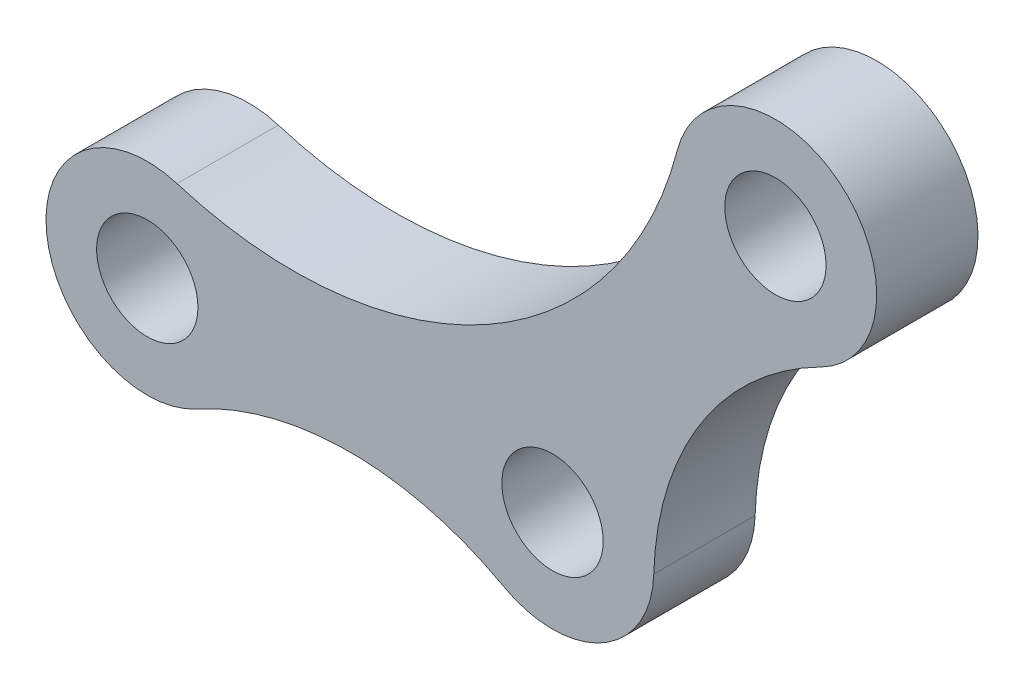
ISO-10303-21;
HEADER;
FILE_DESCRIPTION(('STEP AP214'),'2;1');
FILE_NAME('part.step','',(''),(''),'','','');
FILE_SCHEMA(('AUTOMOTIVE_DESIGN { 1 0 10303 214 1 1 1 1 }'));
ENDSEC;
DATA;
#1=APPLICATION_CONTEXT('core data for automotive mechanical design processes');
#2=APPLICATION_PROTOCOL_DEFINITION('international standard','automotive_design',2000,#1);
#3=PRODUCT_CONTEXT('',#1,'mechanical');
#4=PRODUCT('Part','Part','',(#3));
#5=PRODUCT_RELATED_PRODUCT_CATEGORY('part','',(#4));
#6=PRODUCT_DEFINITION_FORMATION('','',#4);
#7=PRODUCT_DEFINITION_CONTEXT('part definition',#1,'design');
#8=PRODUCT_DEFINITION('design','',#6,#7);
#9=PRODUCT_DEFINITION_SHAPE('','',#8);
#10=(LENGTH_UNIT() NAMED_UNIT(*) SI_UNIT(.MILLI.,.METRE.));
#11=(NAMED_UNIT(*) PLANE_ANGLE_UNIT() SI_UNIT($,.RADIAN.));
#12=(NAMED_UNIT(*) SI_UNIT($,.STERADIAN.) SOLID_ANGLE_UNIT());
#13=UNCERTAINTY_MEASURE_WITH_UNIT(LENGTH_MEASURE(1.E-05),#10,'distance_accuracy_value','');
#14=(GEOMETRIC_REPRESENTATION_CONTEXT(3) GLOBAL_UNCERTAINTY_ASSIGNED_CONTEXT((#13)) GLOBAL_UNIT_ASSIGNED_CONTEXT((#10,
#11,#12)) REPRESENTATION_CONTEXT('',''));
#15=CARTESIAN_POINT('',(0.,0.,0.));
#16=DIRECTION('',(0.,0.,1.));
#17=DIRECTION('',(1.,0.,0.));
#18=AXIS2_PLACEMENT_3D('',#15,#16,#17);
#19=CARTESIAN_POINT('',(31.,17.2988438920062,2.5));
#20=DIRECTION('',(0.,0.,1.));
#21=DIRECTION('',(1.,0.,0.));
#22=AXIS2_PLACEMENT_3D('',#19,#20,#21);
#23=PLANE('',#22);
#24=CARTESIAN_POINT('',(20.,0.,2.5));
#25=DIRECTION('',(0.,0.,1.));
#26=DIRECTION('',(1.,0.,0.));
#27=AXIS2_PLACEMENT_3D('',#24,#25,#26);
#28=CIRCLE('',#27,2.5);
#29=CARTESIAN_POINT('',(22.5,0.,2.5));
#30=VERTEX_POINT('',#29);
#31=EDGE_CURVE('E135',#30,#30,#28,.T.);
#32=ORIENTED_EDGE('',*,*,#31,.F.);
#33=EDGE_LOOP('',(#32));
#34=FACE_BOUND('',#33,.T.);
#35=CARTESIAN_POINT('',(0.,0.,2.5));
#36=DIRECTION('',(0.,0.,1.));
#37=DIRECTION('',(1.,0.,0.));
#38=AXIS2_PLACEMENT_3D('',#35,#36,#37);
#39=CIRCLE('',#38,2.5);
#40=CARTESIAN_POINT('',(2.5,0.,2.5));
#41=VERTEX_POINT('',#40);
#42=EDGE_CURVE('E141',#41,#41,#39,.T.);
#43=ORIENTED_EDGE('',*,*,#42,.F.);
#44=EDGE_LOOP('',(#43));
#45=FACE_BOUND('',#44,.T.);
#46=CARTESIAN_POINT('',(31.,17.2988438920062,2.5));
#47=DIRECTION('',(0.,0.,1.));
#48=DIRECTION('',(1.,0.,0.));
#49=AXIS2_PLACEMENT_3D('',#46,#47,#48);
#50=CIRCLE('',#49,2.5);
#51=CARTESIAN_POINT('',(33.5,17.2988438920062,2.5));
#52=VERTEX_POINT('',#51);
#53=EDGE_CURVE('E129',#52,#52,#50,.T.);
#54=ORIENTED_EDGE('',*,*,#53,.F.);
#55=EDGE_LOOP('',(#54));
#56=FACE_BOUND('',#55,.T.);
#57=CARTESIAN_POINT('',(40.004903122554,-0.573965197332155,2.5));
#58=DIRECTION('',(0.,0.,-1.));
#59=DIRECTION('',(-1.,0.,0.));
#60=AXIS2_PLACEMENT_3D('',#57,#58,#59);
#61=CIRCLE('',#60,15.0131353113528);
#62=CARTESIAN_POINT('',(24.9979433035677,-0.143397121041444,2.5));
#63=VERTEX_POINT('',#62);
#64=CARTESIAN_POINT('',(33.2497482234694,12.8335742550194,2.5));
#65=VERTEX_POINT('',#64);
#66=EDGE_CURVE('E104',#63,#65,#61,.T.);
#67=ORIENTED_EDGE('',*,*,#66,.T.);
#68=CARTESIAN_POINT('',(31.,17.2988438920062,2.5));
#69=DIRECTION('',(0.,0.,1.));
#70=DIRECTION('',(1.,0.,0.));
#71=AXIS2_PLACEMENT_3D('',#68,#69,#70);
#72=CIRCLE('',#71,5.);
#73=CARTESIAN_POINT('',(26.1617899006899,18.5604789560931,2.5));
#74=VERTEX_POINT('',#73);
#75=EDGE_CURVE('E146',#65,#74,#72,.T.);
#76=ORIENTED_EDGE('',*,*,#75,.T.);
#77=CARTESIAN_POINT('',(7.21188646422857,23.5019474218612,2.5));
#78=DIRECTION('',(0.,0.,-1.));
#79=DIRECTION('',(-1.,0.,0.));
#80=AXIS2_PLACEMENT_3D('',#77,#78,#79);
#81=CIRCLE('',#80,19.5835888143463);
#82=CARTESIAN_POINT('',(1.46680912186831,4.78000742677288,2.5));
#83=VERTEX_POINT('',#82);
#84=EDGE_CURVE('E113',#74,#83,#81,.T.);
#85=ORIENTED_EDGE('',*,*,#84,.T.);
#86=CARTESIAN_POINT('',(0.,0.,2.5));
#87=DIRECTION('',(0.,0.,1.));
#88=DIRECTION('',(1.,0.,0.));
#89=AXIS2_PLACEMENT_3D('',#86,#87,#88);
#90=CIRCLE('',#89,5.);
#91=CARTESIAN_POINT('',(2.41669641421285,-4.37716557163774,2.5));
#92=VERTEX_POINT('',#91);
#93=EDGE_CURVE('E43',#83,#92,#90,.T.);
#94=ORIENTED_EDGE('',*,*,#93,.T.);
#95=CARTESIAN_POINT('',(10.,-18.1121863130808,2.5));
#96=DIRECTION('',(0.,0.,-1.));
#97=DIRECTION('',(-1.,0.,0.));
#98=AXIS2_PLACEMENT_3D('',#95,#96,#97);
#99=CIRCLE('',#98,15.6894004997668);
#100=CARTESIAN_POINT('',(17.5833035857871,-4.37716557163774,2.5));
#101=VERTEX_POINT('',#100);
#102=EDGE_CURVE('E108',#92,#101,#99,.T.);
#103=ORIENTED_EDGE('',*,*,#102,.T.);
#104=CARTESIAN_POINT('',(20.,0.,2.5));
#105=DIRECTION('',(0.,0.,1.));
#106=DIRECTION('',(1.,0.,0.));
#107=AXIS2_PLACEMENT_3D('',#104,#105,#106);
#108=CIRCLE('',#107,5.);
#109=EDGE_CURVE('E12',#101,#63,#108,.T.);
#110=ORIENTED_EDGE('',*,*,#109,.T.);
#111=EDGE_LOOP('',(#67,#76,#85,#94,#103,#110));
#112=FACE_BOUND('',#111,.T.);
#113=ADVANCED_FACE('F34',(#34,#45,#56,#112),#23,.T.);
#114=CARTESIAN_POINT('',(31.,17.2988438920062,-2.5));
#115=DIRECTION('',(0.,0.,1.));
#116=DIRECTION('',(1.,0.,0.));
#117=AXIS2_PLACEMENT_3D('',#114,#115,#116);
#118=PLANE('',#117);
#119=CARTESIAN_POINT('',(31.,17.2988438920062,-2.5));
#120=DIRECTION('',(0.,0.,1.));
#121=DIRECTION('',(1.,0.,0.));
#122=AXIS2_PLACEMENT_3D('',#119,#120,#121);
#123=CIRCLE('',#122,2.5);
#124=CARTESIAN_POINT('',(33.5,17.2988438920062,-2.5));
#125=VERTEX_POINT('',#124);
#126=EDGE_CURVE('E118',#125,#125,#123,.T.);
#127=ORIENTED_EDGE('',*,*,#126,.T.);
#128=EDGE_LOOP('',(#127));
#129=FACE_BOUND('',#128,.T.);
#130=CARTESIAN_POINT('',(20.,0.,-2.5));
#131=DIRECTION('',(0.,0.,1.));
#132=DIRECTION('',(1.,0.,0.));
#133=AXIS2_PLACEMENT_3D('',#130,#131,#132);
#134=CIRCLE('',#133,2.5);
#135=CARTESIAN_POINT('',(22.5,0.,-2.5));
#136=VERTEX_POINT('',#135);
#137=EDGE_CURVE('E132',#136,#136,#134,.T.);
#138=ORIENTED_EDGE('',*,*,#137,.T.);
#139=EDGE_LOOP('',(#138));
#140=FACE_BOUND('',#139,.T.);
#141=CARTESIAN_POINT('',(0.,0.,-2.5));
#142=DIRECTION('',(0.,0.,1.));
#143=DIRECTION('',(1.,0.,0.));
#144=AXIS2_PLACEMENT_3D('',#141,#142,#143);
#145=CIRCLE('',#144,2.5);
#146=CARTESIAN_POINT('',(2.5,0.,-2.5));
#147=VERTEX_POINT('',#146);
#148=EDGE_CURVE('E138',#147,#147,#145,.T.);
#149=ORIENTED_EDGE('',*,*,#148,.T.);
#150=EDGE_LOOP('',(#149));
#151=FACE_BOUND('',#150,.T.);
#152=CARTESIAN_POINT('',(31.,17.2988438920062,-2.5));
#153=DIRECTION('',(0.,0.,1.));
#154=DIRECTION('',(1.,0.,0.));
#155=AXIS2_PLACEMENT_3D('',#152,#153,#154);
#156=CIRCLE('',#155,5.);
#157=CARTESIAN_POINT('',(33.2497482234694,12.8335742550194,-2.5));
#158=VERTEX_POINT('',#157);
#159=CARTESIAN_POINT('',(26.1617899006899,18.5604789560931,-2.5));
#160=VERTEX_POINT('',#159);
#161=EDGE_CURVE('E91',#158,#160,#156,.T.);
#162=ORIENTED_EDGE('',*,*,#161,.F.);
#163=CARTESIAN_POINT('',(40.004903122554,-0.573965197332155,-2.5));
#164=DIRECTION('',(0.,0.,-1.));
#165=DIRECTION('',(-1.,0.,0.));
#166=AXIS2_PLACEMENT_3D('',#163,#164,#165);
#167=CIRCLE('',#166,15.0131353113528);
#168=CARTESIAN_POINT('',(24.9979433035677,-0.143397121041444,-2.5));
#169=VERTEX_POINT('',#168);
#170=EDGE_CURVE('E98',#169,#158,#167,.T.);
#171=ORIENTED_EDGE('',*,*,#170,.F.);
#172=CARTESIAN_POINT('',(20.,0.,-2.5));
#173=DIRECTION('',(0.,0.,1.));
#174=DIRECTION('',(1.,0.,0.));
#175=AXIS2_PLACEMENT_3D('',#172,#173,#174);
#176=CIRCLE('',#175,5.);
#177=CARTESIAN_POINT('',(17.5833035857871,-4.37716557163774,-2.5));
#178=VERTEX_POINT('',#177);
#179=EDGE_CURVE('E38',#178,#169,#176,.T.);
#180=ORIENTED_EDGE('',*,*,#179,.F.);
#181=CARTESIAN_POINT('',(10.,-18.1121863130808,-2.5));
#182=DIRECTION('',(0.,0.,-1.));
#183=DIRECTION('',(-1.,0.,0.));
#184=AXIS2_PLACEMENT_3D('',#181,#182,#183);
#185=CIRCLE('',#184,15.6894004997668);
#186=CARTESIAN_POINT('',(2.41669641421285,-4.37716557163774,-2.5));
#187=VERTEX_POINT('',#186);
#188=EDGE_CURVE('E90',#187,#178,#185,.T.);
#189=ORIENTED_EDGE('',*,*,#188,.F.);
#190=CARTESIAN_POINT('',(0.,0.,-2.5));
#191=DIRECTION('',(0.,0.,1.));
#192=DIRECTION('',(1.,0.,0.));
#193=AXIS2_PLACEMENT_3D('',#190,#191,#192);
#194=CIRCLE('',#193,5.);
#195=CARTESIAN_POINT('',(1.46680912186831,4.78000742677288,-2.5));
#196=VERTEX_POINT('',#195);
#197=EDGE_CURVE('E51',#196,#187,#194,.T.);
#198=ORIENTED_EDGE('',*,*,#197,.F.);
#199=CARTESIAN_POINT('',(7.21188646422857,23.5019474218612,-2.5));
#200=DIRECTION('',(0.,0.,-1.));
#201=DIRECTION('',(-1.,0.,0.));
#202=AXIS2_PLACEMENT_3D('',#199,#200,#201);
#203=CIRCLE('',#202,19.5835888143463);
#204=EDGE_CURVE('E88',#160,#196,#203,.T.);
#205=ORIENTED_EDGE('',*,*,#204,.F.);
#206=EDGE_LOOP('',(#162,#171,#180,#189,#198,#205));
#207=FACE_BOUND('',#206,.T.);
#208=ADVANCED_FACE('F86',(#129,#140,#151,#207),#118,.F.);
#209=CARTESIAN_POINT('',(31.,17.2988438920062,2.5));
#210=DIRECTION('',(0.,0.,-1.));
#211=DIRECTION('',(-1.,0.,0.));
#212=AXIS2_PLACEMENT_3D('',#209,#210,#211);
#213=CYLINDRICAL_SURFACE('',#212,5.);
#214=ORIENTED_EDGE('',*,*,#161,.T.);
#215=DIRECTION('',(0.,0.,1.));
#216=VECTOR('',#215,1.);
#217=CARTESIAN_POINT('',(26.1617899006899,18.5604789560931,-2.5));
#218=LINE('',#217,#216);
#219=EDGE_CURVE('E103',#160,#74,#218,.T.);
#220=ORIENTED_EDGE('',*,*,#219,.T.);
#221=ORIENTED_EDGE('',*,*,#75,.F.);
#222=DIRECTION('',(0.,0.,1.));
#223=VECTOR('',#222,1.);
#224=CARTESIAN_POINT('',(33.2497482234694,12.8335742550194,-2.5));
#225=LINE('',#224,#223);
#226=EDGE_CURVE('E119',#158,#65,#225,.T.);
#227=ORIENTED_EDGE('',*,*,#226,.F.);
#228=EDGE_LOOP('',(#214,#220,#221,#227));
#229=FACE_BOUND('',#228,.T.);
#230=ADVANCED_FACE('F36',(#229),#213,.T.);
#231=CARTESIAN_POINT('',(0.,0.,2.5));
#232=DIRECTION('',(0.,0.,-1.));
#233=DIRECTION('',(-1.,0.,0.));
#234=AXIS2_PLACEMENT_3D('',#231,#232,#233);
#235=CYLINDRICAL_SURFACE('',#234,5.);
#236=ORIENTED_EDGE('',*,*,#197,.T.);
#237=DIRECTION('',(0.,0.,1.));
#238=VECTOR('',#237,1.);
#239=CARTESIAN_POINT('',(2.41669641421285,-4.37716557163774,-2.5));
#240=LINE('',#239,#238);
#241=EDGE_CURVE('E97',#187,#92,#240,.T.);
#242=ORIENTED_EDGE('',*,*,#241,.T.);
#243=ORIENTED_EDGE('',*,*,#93,.F.);
#244=DIRECTION('',(0.,0.,1.));
#245=VECTOR('',#244,1.);
#246=CARTESIAN_POINT('',(1.46680912186831,4.78000742677288,-2.5));
#247=LINE('',#246,#245);
#248=EDGE_CURVE('E92',#196,#83,#247,.T.);
#249=ORIENTED_EDGE('',*,*,#248,.F.);
#250=EDGE_LOOP('',(#236,#242,#243,#249));
#251=FACE_BOUND('',#250,.T.);
#252=ADVANCED_FACE('F93',(#251),#235,.T.);
#253=CARTESIAN_POINT('',(20.,0.,2.5));
#254=DIRECTION('',(0.,0.,-1.));
#255=DIRECTION('',(-1.,0.,0.));
#256=AXIS2_PLACEMENT_3D('',#253,#254,#255);
#257=CYLINDRICAL_SURFACE('',#256,5.);
#258=ORIENTED_EDGE('',*,*,#179,.T.);
#259=DIRECTION('',(0.,0.,1.));
#260=VECTOR('',#259,1.);
#261=CARTESIAN_POINT('',(24.9979433035677,-0.143397121041444,-2.5));
#262=LINE('',#261,#260);
#263=EDGE_CURVE('E122',#169,#63,#262,.T.);
#264=ORIENTED_EDGE('',*,*,#263,.T.);
#265=ORIENTED_EDGE('',*,*,#109,.F.);
#266=DIRECTION('',(0.,0.,1.));
#267=VECTOR('',#266,1.);
#268=CARTESIAN_POINT('',(17.5833035857871,-4.37716557163774,-2.5));
#269=LINE('',#268,#267);
#270=EDGE_CURVE('E125',#178,#101,#269,.T.);
#271=ORIENTED_EDGE('',*,*,#270,.F.);
#272=EDGE_LOOP('',(#258,#264,#265,#271));
#273=FACE_BOUND('',#272,.T.);
#274=ADVANCED_FACE('F158',(#273),#257,.T.);
#275=CARTESIAN_POINT('',(0.,0.,2.5));
#276=DIRECTION('',(0.,0.,-1.));
#277=DIRECTION('',(-1.,0.,0.));
#278=AXIS2_PLACEMENT_3D('',#275,#276,#277);
#279=CYLINDRICAL_SURFACE('',#278,2.5);
#280=ORIENTED_EDGE('',*,*,#42,.T.);
#281=EDGE_LOOP('',(#280));
#282=FACE_BOUND('',#281,.T.);
#283=ORIENTED_EDGE('',*,*,#148,.F.);
#284=EDGE_LOOP('',(#283));
#285=FACE_BOUND('',#284,.T.);
#286=ADVANCED_FACE('F175',(#282,#285),#279,.F.);
#287=CARTESIAN_POINT('',(20.,0.,2.5));
#288=DIRECTION('',(0.,0.,-1.));
#289=DIRECTION('',(-1.,0.,0.));
#290=AXIS2_PLACEMENT_3D('',#287,#288,#289);
#291=CYLINDRICAL_SURFACE('',#290,2.5);
#292=ORIENTED_EDGE('',*,*,#31,.T.);
#293=EDGE_LOOP('',(#292));
#294=FACE_BOUND('',#293,.T.);
#295=ORIENTED_EDGE('',*,*,#137,.F.);
#296=EDGE_LOOP('',(#295));
#297=FACE_BOUND('',#296,.T.);
#298=ADVANCED_FACE('F201',(#294,#297),#291,.F.);
#299=CARTESIAN_POINT('',(31.,17.2988438920062,2.5));
#300=DIRECTION('',(0.,0.,-1.));
#301=DIRECTION('',(-1.,0.,0.));
#302=AXIS2_PLACEMENT_3D('',#299,#300,#301);
#303=CYLINDRICAL_SURFACE('',#302,2.5);
#304=ORIENTED_EDGE('',*,*,#53,.T.);
#305=EDGE_LOOP('',(#304));
#306=FACE_BOUND('',#305,.T.);
#307=ORIENTED_EDGE('',*,*,#126,.F.);
#308=EDGE_LOOP('',(#307));
#309=FACE_BOUND('',#308,.T.);
#310=ADVANCED_FACE('F198',(#306,#309),#303,.F.);
#311=CARTESIAN_POINT('',(40.004903122554,-0.573965197332155,-2.5));
#312=DIRECTION('',(0.,0.,1.));
#313=DIRECTION('',(1.,0.,0.));
#314=AXIS2_PLACEMENT_3D('',#311,#312,#313);
#315=CYLINDRICAL_SURFACE('',#314,15.0131353113528);
#316=ORIENTED_EDGE('',*,*,#66,.F.);
#317=ORIENTED_EDGE('',*,*,#263,.F.);
#318=ORIENTED_EDGE('',*,*,#170,.T.);
#319=ORIENTED_EDGE('',*,*,#226,.T.);
#320=EDGE_LOOP('',(#316,#317,#318,#319));
#321=FACE_BOUND('',#320,.T.);
#322=ADVANCED_FACE('F156',(#321),#315,.F.);
#323=CARTESIAN_POINT('',(10.,-18.1121863130808,-2.5));
#324=DIRECTION('',(0.,0.,1.));
#325=DIRECTION('',(1.,0.,0.));
#326=AXIS2_PLACEMENT_3D('',#323,#324,#325);
#327=CYLINDRICAL_SURFACE('',#326,15.6894004997668);
#328=ORIENTED_EDGE('',*,*,#102,.F.);
#329=ORIENTED_EDGE('',*,*,#241,.F.);
#330=ORIENTED_EDGE('',*,*,#188,.T.);
#331=ORIENTED_EDGE('',*,*,#270,.T.);
#332=EDGE_LOOP('',(#328,#329,#330,#331));
#333=FACE_BOUND('',#332,.T.);
#334=ADVANCED_FACE('F161',(#333),#327,.F.);
#335=CARTESIAN_POINT('',(7.21188646422857,23.5019474218612,-2.5));
#336=DIRECTION('',(0.,0.,1.));
#337=DIRECTION('',(1.,0.,0.));
#338=AXIS2_PLACEMENT_3D('',#335,#336,#337);
#339=CYLINDRICAL_SURFACE('',#338,19.5835888143463);
#340=ORIENTED_EDGE('',*,*,#84,.F.);
#341=ORIENTED_EDGE('',*,*,#219,.F.);
#342=ORIENTED_EDGE('',*,*,#204,.T.);
#343=ORIENTED_EDGE('',*,*,#248,.T.);
#344=EDGE_LOOP('',(#340,#341,#342,#343));
#345=FACE_BOUND('',#344,.T.);
#346=ADVANCED_FACE('F101',(#345),#339,.F.);
#347=CLOSED_SHELL('',(#113,#208,#230,#252,#274,#286,#298,#310,#322,#334,#346));
#348=MANIFOLD_SOLID_BREP('B2',#347);
#349=ADVANCED_BREP_SHAPE_REPRESENTATION('',(#18,#348),#14);
#350=SHAPE_DEFINITION_REPRESENTATION(#9,#349);
ENDSEC;
END-ISO-10303-21;
